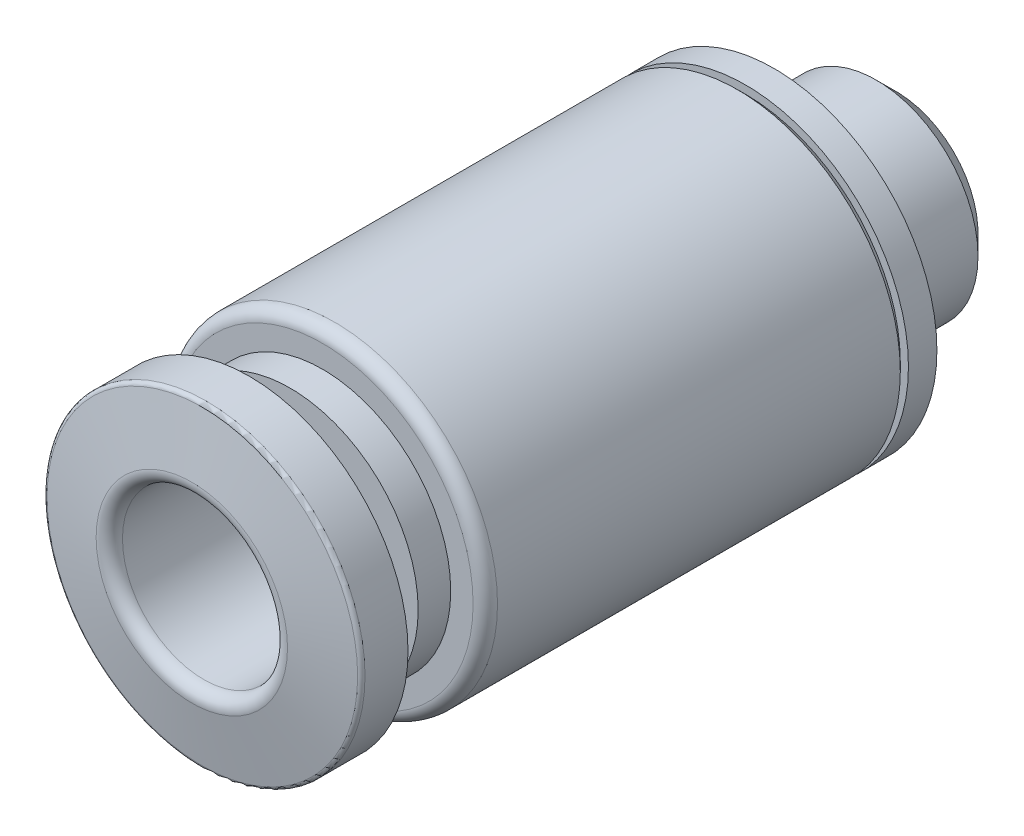
ISO-10303-21;
HEADER;
FILE_DESCRIPTION(('STEP AP214'),'2;1');
FILE_NAME('part.step','',(''),(''),'','','');
FILE_SCHEMA(('AUTOMOTIVE_DESIGN { 1 0 10303 214 1 1 1 1 }'));
ENDSEC;
DATA;
#1=APPLICATION_CONTEXT('core data for automotive mechanical design processes');
#2=APPLICATION_PROTOCOL_DEFINITION('international standard','automotive_design',2000,#1);
#3=PRODUCT_CONTEXT('',#1,'mechanical');
#4=PRODUCT('Part','Part','',(#3));
#5=PRODUCT_RELATED_PRODUCT_CATEGORY('part','',(#4));
#6=PRODUCT_DEFINITION_FORMATION('','',#4);
#7=PRODUCT_DEFINITION_CONTEXT('part definition',#1,'design');
#8=PRODUCT_DEFINITION('design','',#6,#7);
#9=PRODUCT_DEFINITION_SHAPE('','',#8);
#10=(LENGTH_UNIT() NAMED_UNIT(*) SI_UNIT(.MILLI.,.METRE.));
#11=(NAMED_UNIT(*) PLANE_ANGLE_UNIT() SI_UNIT($,.RADIAN.));
#12=(NAMED_UNIT(*) SI_UNIT($,.STERADIAN.) SOLID_ANGLE_UNIT());
#13=UNCERTAINTY_MEASURE_WITH_UNIT(LENGTH_MEASURE(1.E-05),#10,'distance_accuracy_value','');
#14=(GEOMETRIC_REPRESENTATION_CONTEXT(3) GLOBAL_UNCERTAINTY_ASSIGNED_CONTEXT((#13)) GLOBAL_UNIT_ASSIGNED_CONTEXT((#10,
#11,#12)) REPRESENTATION_CONTEXT('',''));
#15=CARTESIAN_POINT('',(0.,0.,0.));
#16=DIRECTION('',(0.,0.,1.));
#17=DIRECTION('',(1.,0.,0.));
#18=AXIS2_PLACEMENT_3D('',#15,#16,#17);
#19=CARTESIAN_POINT('',(-2.0095,-2.0095,0.));
#20=DIRECTION('',(0.,0.,-1.));
#21=DIRECTION('',(0.,1.,0.));
#22=AXIS2_PLACEMENT_3D('',#19,#20,#21);
#23=PLANE('',#22);
#24=CARTESIAN_POINT('',(0.,0.,0.));
#25=DIRECTION('',(0.,0.,-1.));
#26=DIRECTION('',(-1.,0.,0.));
#27=AXIS2_PLACEMENT_3D('',#24,#25,#26);
#28=CIRCLE('',#27,2.00950000000094);
#29=CARTESIAN_POINT('',(-2.00950000000094,0.,0.));
#30=VERTEX_POINT('',#29);
#31=EDGE_CURVE('E477',#30,#30,#28,.T.);
#32=ORIENTED_EDGE('',*,*,#31,.T.);
#33=EDGE_LOOP('',(#32));
#34=FACE_BOUND('',#33,.T.);
#35=CARTESIAN_POINT('',(0.,0.,0.));
#36=DIRECTION('',(0.,0.,1.));
#37=DIRECTION('',(1.,0.,0.));
#38=AXIS2_PLACEMENT_3D('',#35,#36,#37);
#39=CIRCLE('',#38,1.40000000000001);
#40=CARTESIAN_POINT('',(1.40000000000001,0.,0.));
#41=VERTEX_POINT('',#40);
#42=EDGE_CURVE('E494',#41,#41,#39,.T.);
#43=ORIENTED_EDGE('',*,*,#42,.T.);
#44=EDGE_LOOP('',(#43));
#45=FACE_BOUND('',#44,.T.);
#46=ADVANCED_FACE('F50',(#34,#45),#23,.T.);
#47=CARTESIAN_POINT('',(-3.9,-3.9,15.9));
#48=DIRECTION('',(0.,0.,-1.));
#49=DIRECTION('',(0.,1.,0.));
#50=AXIS2_PLACEMENT_3D('',#47,#48,#49);
#51=PLANE('',#50);
#52=CARTESIAN_POINT('',(0.,0.,15.9));
#53=DIRECTION('',(0.,0.,-1.));
#54=DIRECTION('',(1.,0.,0.));
#55=AXIS2_PLACEMENT_3D('',#52,#53,#54);
#56=CIRCLE('',#55,3.9);
#57=CARTESIAN_POINT('',(3.9,0.,15.9));
#58=VERTEX_POINT('',#57);
#59=EDGE_CURVE('E224',#58,#58,#56,.T.);
#60=ORIENTED_EDGE('',*,*,#59,.T.);
#61=EDGE_LOOP('',(#60));
#62=FACE_BOUND('',#61,.T.);
#63=CARTESIAN_POINT('',(0.,0.,15.9));
#64=DIRECTION('',(0.,0.,1.));
#65=DIRECTION('',(-1.,0.,0.));
#66=AXIS2_PLACEMENT_3D('',#63,#64,#65);
#67=CIRCLE('',#66,2.45);
#68=CARTESIAN_POINT('',(-2.45,0.,15.9));
#69=VERTEX_POINT('',#68);
#70=EDGE_CURVE('E706',#69,#69,#67,.F.);
#71=ORIENTED_EDGE('',*,*,#70,.F.);
#72=EDGE_LOOP('',(#71));
#73=FACE_BOUND('',#72,.T.);
#74=ADVANCED_FACE('F241',(#62,#73),#51,.T.);
#75=CARTESIAN_POINT('',(3.15000024195688,-3.15000000000002,14.9));
#76=DIRECTION('',(0.,0.,1.));
#77=DIRECTION('',(0.,1.,0.));
#78=AXIS2_PLACEMENT_3D('',#75,#76,#77);
#79=PLANE('',#78);
#80=CARTESIAN_POINT('',(0.,0.,14.9));
#81=DIRECTION('',(0.,0.,1.));
#82=DIRECTION('',(-1.,0.,0.));
#83=AXIS2_PLACEMENT_3D('',#80,#81,#82);
#84=CIRCLE('',#83,3.15);
#85=CARTESIAN_POINT('',(-3.15,0.,14.9));
#86=VERTEX_POINT('',#85);
#87=EDGE_CURVE('E649',#86,#86,#84,.F.);
#88=ORIENTED_EDGE('',*,*,#87,.F.);
#89=EDGE_LOOP('',(#88));
#90=FACE_BOUND('',#89,.T.);
#91=CARTESIAN_POINT('',(0.,0.,14.9));
#92=DIRECTION('',(0.,0.,-1.));
#93=DIRECTION('',(0.99999999999999,-1.42053914934905E-07,0.));
#94=AXIS2_PLACEMENT_3D('',#91,#92,#93);
#95=CIRCLE('',#94,2.45);
#96=CARTESIAN_POINT('',(2.44999999999998,-3.48032091590516E-07,14.9));
#97=VERTEX_POINT('',#96);
#98=EDGE_CURVE('E643',#97,#97,#95,.T.);
#99=ORIENTED_EDGE('',*,*,#98,.T.);
#100=EDGE_LOOP('',(#99));
#101=FACE_BOUND('',#100,.T.);
#102=ADVANCED_FACE('F245',(#90,#101),#79,.T.);
#103=CARTESIAN_POINT('',(3.60000027634443,-3.60000000000003,14.1));
#104=DIRECTION('',(0.,0.,1.));
#105=DIRECTION('',(0.,1.,0.));
#106=AXIS2_PLACEMENT_3D('',#103,#104,#105);
#107=PLANE('',#106);
#108=CARTESIAN_POINT('',(0.,0.,14.1));
#109=DIRECTION('',(0.,0.,1.));
#110=DIRECTION('',(1.,0.,0.));
#111=AXIS2_PLACEMENT_3D('',#108,#109,#110);
#112=CIRCLE('',#111,3.69999999999999);
#113=CARTESIAN_POINT('',(3.69999999999999,0.,14.1));
#114=VERTEX_POINT('',#113);
#115=EDGE_CURVE('E318',#114,#114,#112,.T.);
#116=ORIENTED_EDGE('',*,*,#115,.T.);
#117=EDGE_LOOP('',(#116));
#118=FACE_BOUND('',#117,.T.);
#119=CARTESIAN_POINT('',(0.,0.,14.1));
#120=DIRECTION('',(0.,0.,-1.));
#121=DIRECTION('',(1.,0.,0.));
#122=AXIS2_PLACEMENT_3D('',#119,#120,#121);
#123=CIRCLE('',#122,3.15);
#124=CARTESIAN_POINT('',(3.15,0.,14.1));
#125=VERTEX_POINT('',#124);
#126=EDGE_CURVE('E648',#125,#125,#123,.T.);
#127=ORIENTED_EDGE('',*,*,#126,.T.);
#128=EDGE_LOOP('',(#127));
#129=FACE_BOUND('',#128,.T.);
#130=ADVANCED_FACE('F249',(#118,#129),#107,.T.);
#131=CARTESIAN_POINT('',(4.,-4.,3.7));
#132=DIRECTION('',(0.,0.,1.));
#133=DIRECTION('',(0.,1.,0.));
#134=AXIS2_PLACEMENT_3D('',#131,#132,#133);
#135=PLANE('',#134);
#136=CARTESIAN_POINT('',(0.,0.,3.7));
#137=DIRECTION('',(0.,0.,1.));
#138=DIRECTION('',(-1.,0.,0.));
#139=AXIS2_PLACEMENT_3D('',#136,#137,#138);
#140=CIRCLE('',#139,4.);
#141=CARTESIAN_POINT('',(-4.,0.,3.7));
#142=VERTEX_POINT('',#141);
#143=EDGE_CURVE('E654',#142,#142,#140,.F.);
#144=ORIENTED_EDGE('',*,*,#143,.F.);
#145=EDGE_LOOP('',(#144));
#146=FACE_BOUND('',#145,.T.);
#147=CARTESIAN_POINT('',(0.,0.,3.7));
#148=DIRECTION('',(0.,0.,-1.));
#149=DIRECTION('',(0.99999999999999,-1.4203197355076E-07,0.));
#150=AXIS2_PLACEMENT_3D('',#147,#148,#149);
#151=CIRCLE('',#150,3.8);
#152=CARTESIAN_POINT('',(3.79999999999996,-5.39721499492889E-07,3.7));
#153=VERTEX_POINT('',#152);
#154=EDGE_CURVE('E679',#153,#153,#151,.T.);
#155=ORIENTED_EDGE('',*,*,#154,.T.);
#156=EDGE_LOOP('',(#155));
#157=FACE_BOUND('',#156,.T.);
#158=ADVANCED_FACE('F253',(#146,#157),#135,.T.);
#159=CARTESIAN_POINT('',(-4.,-4.,3.));
#160=DIRECTION('',(0.,0.,-1.));
#161=DIRECTION('',(0.,1.,0.));
#162=AXIS2_PLACEMENT_3D('',#159,#160,#161);
#163=PLANE('',#162);
#164=CARTESIAN_POINT('',(0.,0.,3.));
#165=DIRECTION('',(0.,0.,-1.));
#166=DIRECTION('',(1.,0.,0.));
#167=AXIS2_PLACEMENT_3D('',#164,#165,#166);
#168=CIRCLE('',#167,4.);
#169=CARTESIAN_POINT('',(4.,0.,3.));
#170=VERTEX_POINT('',#169);
#171=EDGE_CURVE('E684',#170,#170,#168,.T.);
#172=ORIENTED_EDGE('',*,*,#171,.T.);
#173=EDGE_LOOP('',(#172));
#174=FACE_BOUND('',#173,.T.);
#175=CARTESIAN_POINT('',(0.,0.,3.));
#176=DIRECTION('',(0.,0.,1.));
#177=DIRECTION('',(-1.,0.,0.));
#178=AXIS2_PLACEMENT_3D('',#175,#176,#177);
#179=CIRCLE('',#178,2.5);
#180=CARTESIAN_POINT('',(-2.5,0.,3.));
#181=VERTEX_POINT('',#180);
#182=EDGE_CURVE('E693',#181,#181,#179,.F.);
#183=ORIENTED_EDGE('',*,*,#182,.F.);
#184=EDGE_LOOP('',(#183));
#185=FACE_BOUND('',#184,.T.);
#186=ADVANCED_FACE('F257',(#174,#185),#163,.T.);
#187=CARTESIAN_POINT('',(0.,0.,17.0548411696));
#188=DIRECTION('',(0.,0.,-1.));
#189=DIRECTION('',(1.,1.92333826983112E-10,0.));
#190=AXIS2_PLACEMENT_3D('',#187,#188,#189);
#191=CONICAL_SURFACE('',#190,3.81736481776669,1.39626340159545);
#192=CARTESIAN_POINT('',(0.,0.,17.313207868888));
#193=DIRECTION('',(0.,0.,-1.));
#194=DIRECTION('',(-1.,0.,0.));
#195=AXIS2_PLACEMENT_3D('',#192,#193,#194);
#196=CIRCLE('',#195,2.35209445330009);
#197=CARTESIAN_POINT('',(-2.35209445330009,0.,17.313207868888));
#198=VERTEX_POINT('',#197);
#199=EDGE_CURVE('E12',#198,#198,#196,.T.);
#200=ORIENTED_EDGE('',*,*,#199,.T.);
#201=EDGE_LOOP('',(#200));
#202=FACE_BOUND('',#201,.T.);
#203=CARTESIAN_POINT('',(0.,0.,17.0548411696001));
#204=DIRECTION('',(0.,0.,1.));
#205=DIRECTION('',(1.,0.,0.));
#206=AXIS2_PLACEMENT_3D('',#203,#204,#205);
#207=CIRCLE('',#206,3.81736481776594);
#208=CARTESIAN_POINT('',(3.81736481776594,0.,17.0548411696001));
#209=VERTEX_POINT('',#208);
#210=EDGE_CURVE('E323',#209,#209,#207,.T.);
#211=ORIENTED_EDGE('',*,*,#210,.T.);
#212=EDGE_LOOP('',(#211));
#213=FACE_BOUND('',#212,.T.);
#214=ADVANCED_FACE('F261',(#202,#213),#191,.T.);
#215=CARTESIAN_POINT('',(0.,0.,3.));
#216=DIRECTION('',(0.,0.,-1.));
#217=DIRECTION('',(1.,7.69361585891001E-10,0.));
#218=AXIS2_PLACEMENT_3D('',#215,#216,#217);
#219=CYLINDRICAL_SURFACE('',#218,3.9);
#220=CARTESIAN_POINT('',(0.,0.,16.956360394298));
#221=DIRECTION('',(0.,0.,-1.));
#222=DIRECTION('',(-1.,0.,0.));
#223=AXIS2_PLACEMENT_3D('',#220,#221,#222);
#224=CIRCLE('',#223,3.9);
#225=CARTESIAN_POINT('',(-3.9,0.,16.956360394298));
#226=VERTEX_POINT('',#225);
#227=EDGE_CURVE('E319',#226,#226,#224,.T.);
#228=ORIENTED_EDGE('',*,*,#227,.T.);
#229=EDGE_LOOP('',(#228));
#230=FACE_BOUND('',#229,.T.);
#231=ORIENTED_EDGE('',*,*,#59,.F.);
#232=EDGE_LOOP('',(#231));
#233=FACE_BOUND('',#232,.T.);
#234=ADVANCED_FACE('F265',(#230,#233),#219,.T.);
#235=CARTESIAN_POINT('',(0.,0.,3.));
#236=DIRECTION('',(0.,0.,-1.));
#237=DIRECTION('',(1.,0.,0.));
#238=AXIS2_PLACEMENT_3D('',#235,#236,#237);
#239=CYLINDRICAL_SURFACE('',#238,2.45);
#240=ORIENTED_EDGE('',*,*,#98,.F.);
#241=EDGE_LOOP('',(#240));
#242=FACE_BOUND('',#241,.T.);
#243=ORIENTED_EDGE('',*,*,#70,.T.);
#244=EDGE_LOOP('',(#243));
#245=FACE_BOUND('',#244,.T.);
#246=ADVANCED_FACE('F269',(#242,#245),#239,.T.);
#247=CARTESIAN_POINT('',(0.,0.,3.));
#248=DIRECTION('',(0.,0.,-1.));
#249=DIRECTION('',(0.99999999999999,1.42128075209309E-07,0.));
#250=AXIS2_PLACEMENT_3D('',#247,#248,#249);
#251=CYLINDRICAL_SURFACE('',#250,3.15);
#252=ORIENTED_EDGE('',*,*,#126,.F.);
#253=EDGE_LOOP('',(#252));
#254=FACE_BOUND('',#253,.T.);
#255=ORIENTED_EDGE('',*,*,#87,.T.);
#256=EDGE_LOOP('',(#255));
#257=FACE_BOUND('',#256,.T.);
#258=ADVANCED_FACE('F273',(#254,#257),#251,.T.);
#259=CARTESIAN_POINT('',(0.,0.,3.));
#260=DIRECTION('',(0.,0.,-1.));
#261=DIRECTION('',(1.,1.92328497912594E-10,0.));
#262=AXIS2_PLACEMENT_3D('',#259,#260,#261);
#263=CYLINDRICAL_SURFACE('',#262,4.);
#264=CARTESIAN_POINT('',(0.,0.,13.8));
#265=DIRECTION('',(0.,0.,1.));
#266=DIRECTION('',(1.,0.,0.));
#267=AXIS2_PLACEMENT_3D('',#264,#265,#266);
#268=CIRCLE('',#267,4.);
#269=CARTESIAN_POINT('',(4.,0.,13.8));
#270=VERTEX_POINT('',#269);
#271=EDGE_CURVE('E315',#270,#270,#268,.F.);
#272=ORIENTED_EDGE('',*,*,#271,.T.);
#273=EDGE_LOOP('',(#272));
#274=FACE_BOUND('',#273,.T.);
#275=CARTESIAN_POINT('',(0.,0.,3.9));
#276=DIRECTION('',(0.,0.,1.));
#277=DIRECTION('',(-1.,0.,0.));
#278=AXIS2_PLACEMENT_3D('',#275,#276,#277);
#279=CIRCLE('',#278,4.);
#280=CARTESIAN_POINT('',(-4.,0.,3.9));
#281=VERTEX_POINT('',#280);
#282=EDGE_CURVE('E481',#281,#281,#279,.F.);
#283=ORIENTED_EDGE('',*,*,#282,.F.);
#284=EDGE_LOOP('',(#283));
#285=FACE_BOUND('',#284,.T.);
#286=ADVANCED_FACE('F277',(#274,#285),#263,.T.);
#287=CARTESIAN_POINT('',(0.,0.,3.9));
#288=DIRECTION('',(0.,0.,1.));
#289=DIRECTION('',(-1.,0.,0.));
#290=AXIS2_PLACEMENT_3D('',#287,#288,#289);
#291=CONICAL_SURFACE('',#290,4.,0.785398163397447);
#292=ORIENTED_EDGE('',*,*,#154,.F.);
#293=EDGE_LOOP('',(#292));
#294=FACE_BOUND('',#293,.T.);
#295=ORIENTED_EDGE('',*,*,#282,.T.);
#296=EDGE_LOOP('',(#295));
#297=FACE_BOUND('',#296,.T.);
#298=ADVANCED_FACE('F281',(#294,#297),#291,.T.);
#299=CARTESIAN_POINT('',(0.,0.,3.));
#300=DIRECTION('',(0.,0.,-1.));
#301=DIRECTION('',(1.,0.,0.));
#302=AXIS2_PLACEMENT_3D('',#299,#300,#301);
#303=CYLINDRICAL_SURFACE('',#302,4.);
#304=ORIENTED_EDGE('',*,*,#171,.F.);
#305=EDGE_LOOP('',(#304));
#306=FACE_BOUND('',#305,.T.);
#307=ORIENTED_EDGE('',*,*,#143,.T.);
#308=EDGE_LOOP('',(#307));
#309=FACE_BOUND('',#308,.T.);
#310=ADVANCED_FACE('F285',(#306,#309),#303,.T.);
#311=CARTESIAN_POINT('',(0.,0.,0.));
#312=DIRECTION('',(0.,0.,-1.));
#313=DIRECTION('',(1.,1.92342708767309E-10,0.));
#314=AXIS2_PLACEMENT_3D('',#311,#312,#313);
#315=CYLINDRICAL_SURFACE('',#314,2.5);
#316=CARTESIAN_POINT('',(0.,0.,0.490499999999066));
#317=DIRECTION('',(0.,0.,-1.));
#318=DIRECTION('',(-1.,0.,0.));
#319=AXIS2_PLACEMENT_3D('',#316,#317,#318);
#320=CIRCLE('',#319,2.5);
#321=CARTESIAN_POINT('',(-2.5,0.,0.490499999999066));
#322=VERTEX_POINT('',#321);
#323=EDGE_CURVE('E480',#322,#322,#320,.F.);
#324=ORIENTED_EDGE('',*,*,#323,.T.);
#325=EDGE_LOOP('',(#324));
#326=FACE_BOUND('',#325,.T.);
#327=ORIENTED_EDGE('',*,*,#182,.T.);
#328=EDGE_LOOP('',(#327));
#329=FACE_BOUND('',#328,.T.);
#330=ADVANCED_FACE('F289',(#326,#329),#315,.T.);
#331=CARTESIAN_POINT('',(0.,0.,9.64));
#332=DIRECTION('',(0.,0.,1.));
#333=DIRECTION('',(1.,0.,0.));
#334=AXIS2_PLACEMENT_3D('',#331,#332,#333);
#335=CYLINDRICAL_SURFACE('',#334,2.);
#336=CARTESIAN_POINT('',(0.,0.,17.0177655429843));
#337=DIRECTION('',(0.,0.,-1.));
#338=DIRECTION('',(-1.,0.,0.));
#339=AXIS2_PLACEMENT_3D('',#336,#337,#338);
#340=CIRCLE('',#339,2.);
#341=CARTESIAN_POINT('',(-2.,0.,17.0177655429843));
#342=VERTEX_POINT('',#341);
#343=EDGE_CURVE('E58',#342,#342,#340,.F.);
#344=ORIENTED_EDGE('',*,*,#343,.T.);
#345=EDGE_LOOP('',(#344));
#346=FACE_BOUND('',#345,.T.);
#347=CARTESIAN_POINT('',(0.,0.,9.64));
#348=DIRECTION('',(0.,0.,1.));
#349=DIRECTION('',(-1.,0.,0.));
#350=AXIS2_PLACEMENT_3D('',#347,#348,#349);
#351=CIRCLE('',#350,2.);
#352=CARTESIAN_POINT('',(-2.,0.,9.64));
#353=VERTEX_POINT('',#352);
#354=EDGE_CURVE('E336',#353,#353,#351,.T.);
#355=ORIENTED_EDGE('',*,*,#354,.F.);
#356=EDGE_LOOP('',(#355));
#357=FACE_BOUND('',#356,.T.);
#358=ADVANCED_FACE('F293',(#346,#357),#335,.F.);
#359=CARTESIAN_POINT('',(0.,0.,9.64));
#360=DIRECTION('',(0.,0.,-1.));
#361=DIRECTION('',(-1.,0.,0.));
#362=AXIS2_PLACEMENT_3D('',#359,#360,#361);
#363=PLANE('',#362);
#364=DIRECTION('',(0.,1.,0.));
#365=VECTOR('',#364,1.);
#366=CARTESIAN_POINT('',(1.00000000000004,0.57735026918963,9.64));
#367=LINE('',#366,#365);
#368=CARTESIAN_POINT('',(1.00000000000004,-0.577350269189629,9.64));
#369=VERTEX_POINT('',#368);
#370=CARTESIAN_POINT('',(1.00000000000004,0.57735026918963,9.64));
#371=VERTEX_POINT('',#370);
#372=EDGE_CURVE('E495',#369,#371,#367,.T.);
#373=ORIENTED_EDGE('',*,*,#372,.F.);
#374=DIRECTION('',(0.866025403784438,0.5,0.));
#375=VECTOR('',#374,1.);
#376=CARTESIAN_POINT('',(1.00000000000004,-0.577350269189629,9.64));
#377=LINE('',#376,#375);
#378=CARTESIAN_POINT('',(0.,-1.1547005383793,9.64));
#379=VERTEX_POINT('',#378);
#380=EDGE_CURVE('E65',#379,#369,#377,.T.);
#381=ORIENTED_EDGE('',*,*,#380,.F.);
#382=DIRECTION('',(0.866025403784439,-0.5,0.));
#383=VECTOR('',#382,1.);
#384=CARTESIAN_POINT('',(0.,-1.15470053837927,9.64));
#385=LINE('',#384,#383);
#386=CARTESIAN_POINT('',(-1.,-0.57735026918963,9.64));
#387=VERTEX_POINT('',#386);
#388=EDGE_CURVE('E344',#387,#379,#385,.T.);
#389=ORIENTED_EDGE('',*,*,#388,.F.);
#390=DIRECTION('',(0.,-1.,0.));
#391=VECTOR('',#390,1.);
#392=CARTESIAN_POINT('',(-1.,-0.57735026918963,9.64));
#393=LINE('',#392,#391);
#394=CARTESIAN_POINT('',(-1.,0.57735026918963,9.64));
#395=VERTEX_POINT('',#394);
#396=EDGE_CURVE('E575',#395,#387,#393,.T.);
#397=ORIENTED_EDGE('',*,*,#396,.F.);
#398=DIRECTION('',(-0.866025403784439,-0.5,0.));
#399=VECTOR('',#398,1.);
#400=CARTESIAN_POINT('',(-1.,0.57735026918963,9.64));
#401=LINE('',#400,#399);
#402=CARTESIAN_POINT('',(0.,1.15470053837927,9.64));
#403=VERTEX_POINT('',#402);
#404=EDGE_CURVE('E572',#403,#395,#401,.T.);
#405=ORIENTED_EDGE('',*,*,#404,.F.);
#406=DIRECTION('',(-0.866025403784439,0.5,0.));
#407=VECTOR('',#406,1.);
#408=CARTESIAN_POINT('',(0.,1.15470053837927,9.64));
#409=LINE('',#408,#407);
#410=EDGE_CURVE('E497',#371,#403,#409,.T.);
#411=ORIENTED_EDGE('',*,*,#410,.F.);
#412=EDGE_LOOP('',(#373,#381,#389,#397,#405,#411));
#413=FACE_BOUND('',#412,.T.);
#414=ORIENTED_EDGE('',*,*,#354,.T.);
#415=EDGE_LOOP('',(#414));
#416=FACE_BOUND('',#415,.T.);
#417=ADVANCED_FACE('F332',(#413,#416),#363,.F.);
#418=CARTESIAN_POINT('',(8.07589920738451E-12,-1.15470053838396,0.141623709490002));
#419=DIRECTION('',(0.500000000000029,0.866025403784422,0.));
#420=DIRECTION('',(-0.866025403784422,0.500000000000029,0.));
#421=AXIS2_PLACEMENT_3D('',#418,#419,#420);
#422=PLANE('',#421);
#423=ORIENTED_EDGE('',*,*,#388,.T.);
#424=DIRECTION('',(4.72168145894691E-13,-2.72600501288819E-13,-1.));
#425=VECTOR('',#424,1.);
#426=CARTESIAN_POINT('',(0.,-1.1547005383793,9.64));
#427=LINE('',#426,#425);
#428=CARTESIAN_POINT('',(2.28456450887489E-12,-1.15470053837798,0.141623710199547));
#429=VERTEX_POINT('',#428);
#430=EDGE_CURVE('E218',#379,#429,#427,.T.);
#431=ORIENTED_EDGE('',*,*,#430,.T.);
#432=CARTESIAN_POINT('',(4.48464721449681E-12,-1.15470053838189,0.141623710194591));
#433=CARTESIAN_POINT('',(-0.356252216676363,-0.949018225181785,0.260374448972169));
#434=CARTESIAN_POINT('',(-0.641786852099625,-0.78416472655719,0.26102809215996));
#435=CARTESIAN_POINT('',(-0.999999998940165,-0.577350269801526,0.141623709490002));
#436=B_SPLINE_CURVE_WITH_KNOTS('',3,(#432,#433,#434,#435),.UNSPECIFIED.,.F.,.F.,(4,4),(0.,1.),.UNSPECIFIED.);
#437=CARTESIAN_POINT('',(-0.499970779888059,-0.866010475038886,0.23095600707649));
#438=VERTEX_POINT('',#437);
#439=EDGE_CURVE('E368',#429,#438,#436,.T.);
#440=ORIENTED_EDGE('',*,*,#439,.T.);
#441=CARTESIAN_POINT('',(4.48464721449681E-12,-1.15470053838189,0.141623710194591));
#442=CARTESIAN_POINT('',(-0.356252216676363,-0.949018225181785,0.260374448972169));
#443=CARTESIAN_POINT('',(-0.641786852099625,-0.78416472655719,0.26102809215996));
#444=CARTESIAN_POINT('',(-0.999999998940165,-0.577350269801526,0.141623709490002));
#445=B_SPLINE_CURVE_WITH_KNOTS('',3,(#441,#442,#443,#444),.UNSPECIFIED.,.F.,.F.,(4,4),(0.,1.),.UNSPECIFIED.);
#446=CARTESIAN_POINT('',(-1.,-0.577350270718256,0.141623709757879));
#447=VERTEX_POINT('',#446);
#448=EDGE_CURVE('E424',#438,#447,#445,.T.);
#449=ORIENTED_EDGE('',*,*,#448,.T.);
#450=DIRECTION('',(0.,-1.6115531024838E-10,-1.));
#451=VECTOR('',#450,1.);
#452=CARTESIAN_POINT('',(-1.,-0.57735026918963,9.64));
#453=LINE('',#452,#451);
#454=EDGE_CURVE('E338',#387,#447,#453,.T.);
#455=ORIENTED_EDGE('',*,*,#454,.F.);
#456=EDGE_LOOP('',(#423,#431,#440,#449,#455));
#457=FACE_BOUND('',#456,.T.);
#458=ADVANCED_FACE('F375',(#457),#422,.T.);
#459=CARTESIAN_POINT('',(1.0000000000383,-0.577350269167519,0.141623710186046));
#460=DIRECTION('',(-0.500000000000029,0.866025403784422,0.));
#461=DIRECTION('',(-0.866025403784422,-0.500000000000029,0.));
#462=AXIS2_PLACEMENT_3D('',#459,#460,#461);
#463=PLANE('',#462);
#464=ORIENTED_EDGE('',*,*,#380,.T.);
#465=DIRECTION('',(6.25945546909502E-13,3.61386772097176E-13,-1.));
#466=VECTOR('',#465,1.);
#467=CARTESIAN_POINT('',(1.,-0.57735026918963,9.64));
#468=LINE('',#467,#466);
#469=CARTESIAN_POINT('',(1.,-0.577350269186513,0.141623710199712));
#470=VERTEX_POINT('',#469);
#471=EDGE_CURVE('E436',#369,#470,#468,.T.);
#472=ORIENTED_EDGE('',*,*,#471,.T.);
#473=CARTESIAN_POINT('',(1.00000000000595,-0.577350269186197,0.141623710197549));
#474=CARTESIAN_POINT('',(0.643747782947993,-0.783032582604023,0.260374449225133));
#475=CARTESIAN_POINT('',(0.358213147222624,-0.947886081403039,0.261028092613158));
#476=CARTESIAN_POINT('',(2.91260071616506E-12,-1.15470053837762,0.141623710194591));
#477=B_SPLINE_CURVE_WITH_KNOTS('',3,(#473,#474,#475,#476),.UNSPECIFIED.,.F.,.F.,(4,4),(0.,1.),.UNSPECIFIED.);
#478=CARTESIAN_POINT('',(0.500001774727813,-0.865992580157584,0.23095600707649));
#479=VERTEX_POINT('',#478);
#480=EDGE_CURVE('E129',#470,#479,#477,.T.);
#481=ORIENTED_EDGE('',*,*,#480,.T.);
#482=CARTESIAN_POINT('',(1.00000000000595,-0.577350269186197,0.141623710197549));
#483=CARTESIAN_POINT('',(0.643747782947993,-0.783032582604023,0.260374449225133));
#484=CARTESIAN_POINT('',(0.358213147222624,-0.947886081403039,0.261028092613158));
#485=CARTESIAN_POINT('',(2.91260071616506E-12,-1.15470053837762,0.141623710194591));
#486=B_SPLINE_CURVE_WITH_KNOTS('',3,(#482,#483,#484,#485),.UNSPECIFIED.,.F.,.F.,(4,4),(0.,1.),.UNSPECIFIED.);
#487=EDGE_CURVE('E439',#479,#429,#486,.T.);
#488=ORIENTED_EDGE('',*,*,#487,.T.);
#489=ORIENTED_EDGE('',*,*,#430,.F.);
#490=EDGE_LOOP('',(#464,#472,#481,#488,#489));
#491=FACE_BOUND('',#490,.T.);
#492=ADVANCED_FACE('F165',(#491),#463,.T.);
#493=CARTESIAN_POINT('',(1.,-0.577350269189814,0.141623708783196));
#494=DIRECTION('',(-1.,0.,0.));
#495=DIRECTION('',(0.,0.,1.));
#496=AXIS2_PLACEMENT_3D('',#493,#494,#495);
#497=PLANE('',#496);
#498=ORIENTED_EDGE('',*,*,#372,.T.);
#499=DIRECTION('',(0.,1.6115531024838E-10,-1.));
#500=VECTOR('',#499,1.);
#501=CARTESIAN_POINT('',(1.,0.57735026918963,9.64));
#502=LINE('',#501,#500);
#503=CARTESIAN_POINT('',(0.999999999450211,0.577350269507051,0.141623710382075));
#504=VERTEX_POINT('',#503);
#505=EDGE_CURVE('E144',#371,#504,#502,.T.);
#506=ORIENTED_EDGE('',*,*,#505,.T.);
#507=CARTESIAN_POINT('',(1.,0.577350270720344,0.141623709490002));
#508=CARTESIAN_POINT('',(1.,0.387912540251755,0.196327341174808));
#509=CARTESIAN_POINT('',(1.,0.19801104986192,0.231033188640055));
#510=CARTESIAN_POINT('',(1.,2.49007320839156E-08,0.230959846508118));
#511=B_SPLINE_CURVE_WITH_KNOTS('',3,(#507,#508,#509,#510),.UNSPECIFIED.,.F.,.F.,(4,4),(0.,1.),.UNSPECIFIED.);
#512=CARTESIAN_POINT('',(0.99997246143029,0.,0.23095600707649));
#513=VERTEX_POINT('',#512);
#514=EDGE_CURVE('E125',#504,#513,#511,.T.);
#515=ORIENTED_EDGE('',*,*,#514,.T.);
#516=CARTESIAN_POINT('',(1.,2.49007320839156E-08,0.230959846508118));
#517=CARTESIAN_POINT('',(1.,-0.199471450955648,0.230848771823538));
#518=CARTESIAN_POINT('',(1.,-0.387446267381739,0.196461995194912));
#519=CARTESIAN_POINT('',(1.,-0.577350269184158,0.141623710197549));
#520=B_SPLINE_CURVE_WITH_KNOTS('',3,(#516,#517,#518,#519),.UNSPECIFIED.,.F.,.F.,(4,4),(0.,1.),.UNSPECIFIED.);
#521=EDGE_CURVE('E120',#513,#470,#520,.T.);
#522=ORIENTED_EDGE('',*,*,#521,.T.);
#523=ORIENTED_EDGE('',*,*,#471,.F.);
#524=EDGE_LOOP('',(#498,#506,#515,#522,#523));
#525=FACE_BOUND('',#524,.T.);
#526=ADVANCED_FACE('F142',(#525),#497,.T.);
#527=CARTESIAN_POINT('',(-8.07597380049398E-12,1.15470053838396,0.141623709490002));
#528=DIRECTION('',(-0.500000000000029,-0.866025403784422,0.));
#529=DIRECTION('',(0.866025403784422,-0.500000000000029,0.));
#530=AXIS2_PLACEMENT_3D('',#527,#528,#529);
#531=PLANE('',#530);
#532=ORIENTED_EDGE('',*,*,#410,.T.);
#533=DIRECTION('',(-4.7219107566831E-13,2.7262387840067E-13,-1.));
#534=VECTOR('',#533,1.);
#535=CARTESIAN_POINT('',(0.,1.1547005383793,9.64));
#536=LINE('',#535,#534);
#537=CARTESIAN_POINT('',(-2.28456345023431E-12,1.15470053837798,0.141623710199547));
#538=VERTEX_POINT('',#537);
#539=EDGE_CURVE('E136',#403,#538,#536,.T.);
#540=ORIENTED_EDGE('',*,*,#539,.T.);
#541=CARTESIAN_POINT('',(-4.4848732500514E-12,1.15470053838189,0.141623710194591));
#542=CARTESIAN_POINT('',(0.356252216676363,0.949018225181785,0.260374448972169));
#543=CARTESIAN_POINT('',(0.641786852099625,0.78416472655719,0.26102809215996));
#544=CARTESIAN_POINT('',(0.999999998940166,0.577350269801525,0.141623709490002));
#545=B_SPLINE_CURVE_WITH_KNOTS('',3,(#541,#542,#543,#544),.UNSPECIFIED.,.F.,.F.,(4,4),(0.,1.),.UNSPECIFIED.);
#546=CARTESIAN_POINT('',(0.499970686295011,0.866010529072625,0.23095600707649));
#547=VERTEX_POINT('',#546);
#548=EDGE_CURVE('E475',#538,#547,#545,.T.);
#549=ORIENTED_EDGE('',*,*,#548,.T.);
#550=CARTESIAN_POINT('',(-4.4848732500514E-12,1.15470053838189,0.141623710194591));
#551=CARTESIAN_POINT('',(0.356252216676363,0.949018225181785,0.260374448972169));
#552=CARTESIAN_POINT('',(0.641786852099625,0.78416472655719,0.26102809215996));
#553=CARTESIAN_POINT('',(0.999999998940166,0.577350269801525,0.141623709490002));
#554=B_SPLINE_CURVE_WITH_KNOTS('',3,(#550,#551,#552,#553),.UNSPECIFIED.,.F.,.F.,(4,4),(0.,1.),.UNSPECIFIED.);
#555=EDGE_CURVE('E210',#547,#504,#554,.T.);
#556=ORIENTED_EDGE('',*,*,#555,.T.);
#557=ORIENTED_EDGE('',*,*,#505,.F.);
#558=EDGE_LOOP('',(#532,#540,#549,#556,#557));
#559=FACE_BOUND('',#558,.T.);
#560=ADVANCED_FACE('F164',(#559),#531,.T.);
#561=CARTESIAN_POINT('',(-1.0000000000383,0.577350269167518,0.141623710186046));
#562=DIRECTION('',(0.500000000000029,-0.866025403784422,0.));
#563=DIRECTION('',(0.866025403784422,0.500000000000029,0.));
#564=AXIS2_PLACEMENT_3D('',#561,#562,#563);
#565=PLANE('',#564);
#566=ORIENTED_EDGE('',*,*,#404,.T.);
#567=DIRECTION('',(0.,1.17657003943614E-12,1.));
#568=VECTOR('',#567,1.);
#569=CARTESIAN_POINT('',(-1.,0.577350269178455,0.141623710193624));
#570=LINE('',#569,#568);
#571=CARTESIAN_POINT('',(-1.,0.577350269187741,0.141623710199358));
#572=VERTEX_POINT('',#571);
#573=EDGE_CURVE('E403',#395,#572,#570,.F.);
#574=ORIENTED_EDGE('',*,*,#573,.T.);
#575=CARTESIAN_POINT('',(-1.00000000001175,0.577350269182849,0.141623710193624));
#576=CARTESIAN_POINT('',(-0.643747782951726,0.783032582601867,0.260374449222606));
#577=CARTESIAN_POINT('',(-0.358213147224702,0.94788608140184,0.261028092611752));
#578=CARTESIAN_POINT('',(-2.91260071616506E-12,1.15470053837762,0.141623710194591));
#579=B_SPLINE_CURVE_WITH_KNOTS('',3,(#575,#576,#577,#578),.UNSPECIFIED.,.F.,.F.,(4,4),(0.,1.),.UNSPECIFIED.);
#580=CARTESIAN_POINT('',(-0.500001773993396,0.865992580581617,0.23095600707649));
#581=VERTEX_POINT('',#580);
#582=EDGE_CURVE('E699',#572,#581,#579,.T.);
#583=ORIENTED_EDGE('',*,*,#582,.T.);
#584=CARTESIAN_POINT('',(-1.00000000001175,0.577350269182849,0.141623710193624));
#585=CARTESIAN_POINT('',(-0.643747782951726,0.783032582601867,0.260374449222606));
#586=CARTESIAN_POINT('',(-0.358213147224702,0.94788608140184,0.261028092611752));
#587=CARTESIAN_POINT('',(-2.91260071616506E-12,1.15470053837762,0.141623710194591));
#588=B_SPLINE_CURVE_WITH_KNOTS('',3,(#584,#585,#586,#587),.UNSPECIFIED.,.F.,.F.,(4,4),(0.,1.),.UNSPECIFIED.);
#589=EDGE_CURVE('E217',#581,#538,#588,.T.);
#590=ORIENTED_EDGE('',*,*,#589,.T.);
#591=ORIENTED_EDGE('',*,*,#539,.F.);
#592=EDGE_LOOP('',(#566,#574,#583,#590,#591));
#593=FACE_BOUND('',#592,.T.);
#594=ADVANCED_FACE('F229',(#593),#565,.T.);
#595=CARTESIAN_POINT('',(-1.,-0.577350274093459,9.64));
#596=DIRECTION('',(1.,0.,0.));
#597=DIRECTION('',(0.,0.,-1.));
#598=AXIS2_PLACEMENT_3D('',#595,#596,#597);
#599=PLANE('',#598);
#600=ORIENTED_EDGE('',*,*,#396,.T.);
#601=ORIENTED_EDGE('',*,*,#454,.T.);
#602=CARTESIAN_POINT('',(-1.,-0.577350270720344,0.141623709490002));
#603=CARTESIAN_POINT('',(-1.,-0.387912540388916,0.196327605477902));
#604=CARTESIAN_POINT('',(-1.,-0.198011050095901,0.231033717860703));
#605=CARTESIAN_POINT('',(-1.,-2.52791398924757E-08,0.230960651988162));
#606=B_SPLINE_CURVE_WITH_KNOTS('',3,(#602,#603,#604,#605),.UNSPECIFIED.,.F.,.F.,(4,4),(0.,1.),.UNSPECIFIED.);
#607=CARTESIAN_POINT('',(-0.999981831970063,-2.52790736081353E-08,0.230957445096931));
#608=VERTEX_POINT('',#607);
#609=EDGE_CURVE('E342',#447,#608,#606,.T.);
#610=ORIENTED_EDGE('',*,*,#609,.T.);
#611=CARTESIAN_POINT('',(-1.,-2.52791398924757E-08,0.230960651988162));
#612=CARTESIAN_POINT('',(-1.,0.199471450706056,0.230849299135843));
#613=CARTESIAN_POINT('',(-1.,0.387446267242353,0.196462260261205));
#614=CARTESIAN_POINT('',(-1.,0.577350269178455,0.141623710193625));
#615=B_SPLINE_CURVE_WITH_KNOTS('',3,(#611,#612,#613,#614),.UNSPECIFIED.,.F.,.F.,(4,4),(0.,1.),.UNSPECIFIED.);
#616=EDGE_CURVE('E73',#608,#572,#615,.T.);
#617=ORIENTED_EDGE('',*,*,#616,.T.);
#618=ORIENTED_EDGE('',*,*,#573,.F.);
#619=EDGE_LOOP('',(#600,#601,#610,#617,#618));
#620=FACE_BOUND('',#619,.T.);
#621=ADVANCED_FACE('F238',(#620),#599,.T.);
#622=CARTESIAN_POINT('',(0.,0.,0.23095600707649));
#623=DIRECTION('',(0.,0.,-1.));
#624=DIRECTION('',(-1.,0.,0.));
#625=AXIS2_PLACEMENT_3D('',#622,#623,#624);
#626=CONICAL_SURFACE('',#625,0.99997246143029,1.0471975511966);
#627=ORIENTED_EDGE('',*,*,#448,.F.);
#628=ORIENTED_EDGE('',*,*,#439,.F.);
#629=ORIENTED_EDGE('',*,*,#487,.F.);
#630=ORIENTED_EDGE('',*,*,#480,.F.);
#631=ORIENTED_EDGE('',*,*,#521,.F.);
#632=ORIENTED_EDGE('',*,*,#514,.F.);
#633=ORIENTED_EDGE('',*,*,#555,.F.);
#634=ORIENTED_EDGE('',*,*,#548,.F.);
#635=ORIENTED_EDGE('',*,*,#589,.F.);
#636=ORIENTED_EDGE('',*,*,#582,.F.);
#637=ORIENTED_EDGE('',*,*,#616,.F.);
#638=ORIENTED_EDGE('',*,*,#609,.F.);
#639=EDGE_LOOP('',(#627,#628,#629,#630,#631,#632,#633,#634,#635,#636,#637,#638));
#640=FACE_BOUND('',#639,.T.);
#641=ORIENTED_EDGE('',*,*,#42,.F.);
#642=EDGE_LOOP('',(#641));
#643=FACE_BOUND('',#642,.T.);
#644=ADVANCED_FACE('F123',(#640,#643),#626,.F.);
#645=CARTESIAN_POINT('',(0.,0.,0.));
#646=DIRECTION('',(0.,0.,1.));
#647=DIRECTION('',(1.,0.,0.));
#648=AXIS2_PLACEMENT_3D('',#645,#646,#647);
#649=CONICAL_SURFACE('',#648,2.00950000000094,0.785398163397441);
#650=ORIENTED_EDGE('',*,*,#323,.F.);
#651=EDGE_LOOP('',(#650));
#652=FACE_BOUND('',#651,.T.);
#653=ORIENTED_EDGE('',*,*,#31,.F.);
#654=EDGE_LOOP('',(#653));
#655=FACE_BOUND('',#654,.T.);
#656=ADVANCED_FACE('F296',(#652,#655),#649,.T.);
#657=CARTESIAN_POINT('',(0.,0.,16.956360394298));
#658=DIRECTION('',(0.,0.,-1.));
#659=DIRECTION('',(-1.,0.,0.));
#660=AXIS2_PLACEMENT_3D('',#657,#658,#659);
#661=TOROIDAL_SURFACE('',#660,3.79999999999909,0.100000000000907);
#662=ORIENTED_EDGE('',*,*,#227,.F.);
#663=EDGE_LOOP('',(#662));
#664=FACE_BOUND('',#663,.T.);
#665=ORIENTED_EDGE('',*,*,#210,.F.);
#666=EDGE_LOOP('',(#665));
#667=FACE_BOUND('',#666,.T.);
#668=ADVANCED_FACE('F301',(#664,#667),#661,.T.);
#669=CARTESIAN_POINT('',(0.,0.,13.8));
#670=DIRECTION('',(0.,0.,1.));
#671=DIRECTION('',(1.,0.,0.));
#672=AXIS2_PLACEMENT_3D('',#669,#670,#671);
#673=TOROIDAL_SURFACE('',#672,3.69999999999999,0.300000000000006);
#674=ORIENTED_EDGE('',*,*,#271,.F.);
#675=EDGE_LOOP('',(#674));
#676=FACE_BOUND('',#675,.T.);
#677=ORIENTED_EDGE('',*,*,#115,.F.);
#678=EDGE_LOOP('',(#677));
#679=FACE_BOUND('',#678,.T.);
#680=ADVANCED_FACE('F304',(#676,#679),#673,.T.);
#681=CARTESIAN_POINT('',(0.,0.,17.0177655429843));
#682=DIRECTION('',(0.,0.,-1.));
#683=DIRECTION('',(-1.,0.,0.));
#684=AXIS2_PLACEMENT_3D('',#681,#682,#683);
#685=TOROIDAL_SURFACE('',#684,2.30000000000001,0.300000000000006);
#686=ORIENTED_EDGE('',*,*,#199,.F.);
#687=EDGE_LOOP('',(#686));
#688=FACE_BOUND('',#687,.T.);
#689=ORIENTED_EDGE('',*,*,#343,.F.);
#690=EDGE_LOOP('',(#689));
#691=FACE_BOUND('',#690,.T.);
#692=ADVANCED_FACE('F52',(#688,#691),#685,.T.);
#693=CLOSED_SHELL('',(#46,#74,#102,#130,#158,#186,#214,#234,#246,#258,#286,#298,#310,#330,#358,
#417,#458,#492,#526,#560,#594,#621,#644,#656,#668,#680,#692));
#694=MANIFOLD_SOLID_BREP('B2',#693);
#695=ADVANCED_BREP_SHAPE_REPRESENTATION('',(#18,#694),#14);
#696=SHAPE_DEFINITION_REPRESENTATION(#9,#695);
ENDSEC;
END-ISO-10303-21;
